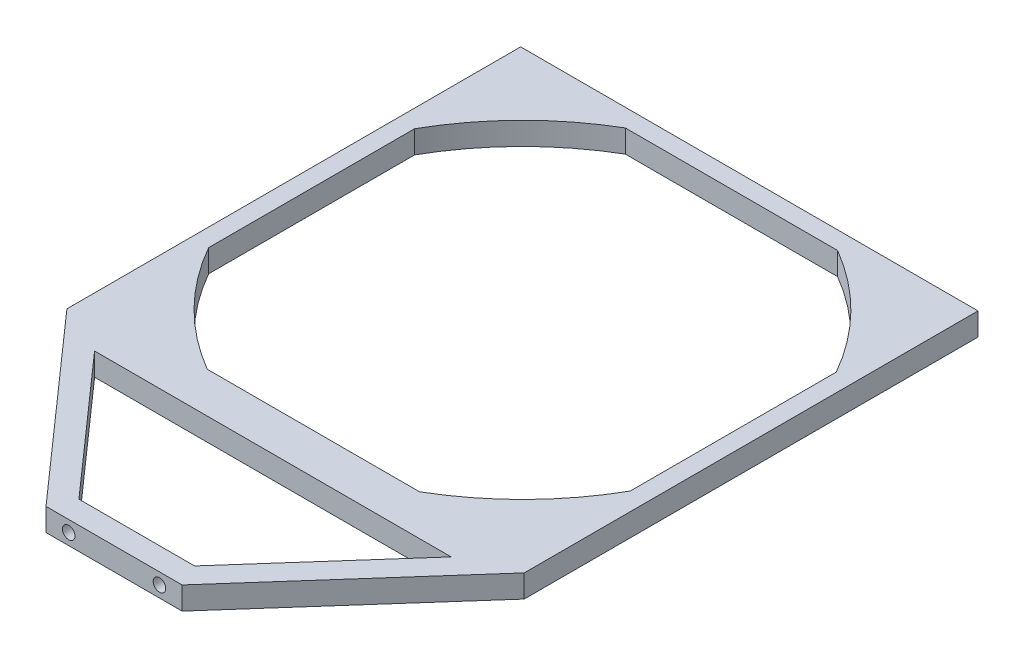
ISO-10303-21;
HEADER;
FILE_DESCRIPTION(('STEP AP214'),'2;1');
FILE_NAME('part.step','',(''),(''),'','','');
FILE_SCHEMA(('AUTOMOTIVE_DESIGN { 1 0 10303 214 1 1 1 1 }'));
ENDSEC;
DATA;
#1=APPLICATION_CONTEXT('core data for automotive mechanical design processes');
#2=APPLICATION_PROTOCOL_DEFINITION('international standard','automotive_design',2000,#1);
#3=PRODUCT_CONTEXT('',#1,'mechanical');
#4=PRODUCT('Part','Part','',(#3));
#5=PRODUCT_RELATED_PRODUCT_CATEGORY('part','',(#4));
#6=PRODUCT_DEFINITION_FORMATION('','',#4);
#7=PRODUCT_DEFINITION_CONTEXT('part definition',#1,'design');
#8=PRODUCT_DEFINITION('design','',#6,#7);
#9=PRODUCT_DEFINITION_SHAPE('','',#8);
#10=(LENGTH_UNIT() NAMED_UNIT(*) SI_UNIT(.MILLI.,.METRE.));
#11=(NAMED_UNIT(*) PLANE_ANGLE_UNIT() SI_UNIT($,.RADIAN.));
#12=(NAMED_UNIT(*) SI_UNIT($,.STERADIAN.) SOLID_ANGLE_UNIT());
#13=UNCERTAINTY_MEASURE_WITH_UNIT(LENGTH_MEASURE(1.E-05),#10,'distance_accuracy_value','');
#14=(GEOMETRIC_REPRESENTATION_CONTEXT(3) GLOBAL_UNCERTAINTY_ASSIGNED_CONTEXT((#13)) GLOBAL_UNIT_ASSIGNED_CONTEXT((#10,
#11,#12)) REPRESENTATION_CONTEXT('',''));
#15=CARTESIAN_POINT('',(0.,0.,0.));
#16=DIRECTION('',(0.,0.,1.));
#17=DIRECTION('',(1.,0.,0.));
#18=AXIS2_PLACEMENT_3D('',#15,#16,#17);
#19=CARTESIAN_POINT('',(-64.,6.35,63.4999999999999));
#20=DIRECTION('',(0.,1.,0.));
#21=DIRECTION('',(0.,0.,1.));
#22=AXIS2_PLACEMENT_3D('',#19,#20,#21);
#23=PLANE('',#22);
#24=DIRECTION('',(0.,0.,1.));
#25=VECTOR('',#24,1.);
#26=CARTESIAN_POINT('',(-64.,6.35,-63.5));
#27=LINE('',#26,#25);
#28=CARTESIAN_POINT('',(-64.,6.35,-63.5));
#29=VERTEX_POINT('',#28);
#30=CARTESIAN_POINT('',(-64.,6.35,63.4999999999999));
#31=VERTEX_POINT('',#30);
#32=EDGE_CURVE('E282',#29,#31,#27,.T.);
#33=ORIENTED_EDGE('',*,*,#32,.T.);
#34=DIRECTION('',(0.662669304581894,0.,0.748912139549727));
#35=VECTOR('',#34,1.);
#36=CARTESIAN_POINT('',(-64.,6.35,63.4999999999999));
#37=LINE('',#36,#35);
#38=CARTESIAN_POINT('',(-19.05,6.35,114.3));
#39=VERTEX_POINT('',#38);
#40=EDGE_CURVE('E203',#31,#39,#37,.T.);
#41=ORIENTED_EDGE('',*,*,#40,.T.);
#42=DIRECTION('',(1.,0.,0.));
#43=VECTOR('',#42,1.);
#44=CARTESIAN_POINT('',(-19.05,6.35,114.3));
#45=LINE('',#44,#43);
#46=CARTESIAN_POINT('',(19.05,6.35,114.3));
#47=VERTEX_POINT('',#46);
#48=EDGE_CURVE('E220',#39,#47,#45,.T.);
#49=ORIENTED_EDGE('',*,*,#48,.T.);
#50=DIRECTION('',(0.662669304581894,0.,-0.748912139549727));
#51=VECTOR('',#50,1.);
#52=CARTESIAN_POINT('',(19.05,6.35,114.3));
#53=LINE('',#52,#51);
#54=CARTESIAN_POINT('',(64.,6.35,63.5));
#55=VERTEX_POINT('',#54);
#56=EDGE_CURVE('E211',#47,#55,#53,.T.);
#57=ORIENTED_EDGE('',*,*,#56,.T.);
#58=DIRECTION('',(0.,0.,-1.));
#59=VECTOR('',#58,1.);
#60=CARTESIAN_POINT('',(64.,6.35,63.5));
#61=LINE('',#60,#59);
#62=CARTESIAN_POINT('',(64.,6.35,-63.5));
#63=VERTEX_POINT('',#62);
#64=EDGE_CURVE('E284',#55,#63,#61,.T.);
#65=ORIENTED_EDGE('',*,*,#64,.T.);
#66=DIRECTION('',(-1.,0.,0.));
#67=VECTOR('',#66,1.);
#68=CARTESIAN_POINT('',(64.,6.35,-63.5));
#69=LINE('',#68,#67);
#70=EDGE_CURVE('E287',#63,#29,#69,.T.);
#71=ORIENTED_EDGE('',*,*,#70,.T.);
#72=EDGE_LOOP('',(#33,#41,#49,#57,#65,#71));
#73=FACE_BOUND('',#72,.T.);
#74=DIRECTION('',(0.,0.,1.));
#75=VECTOR('',#74,1.);
#76=CARTESIAN_POINT('',(-59.,6.35,-28.8258848548213));
#77=LINE('',#76,#75);
#78=CARTESIAN_POINT('',(-59.,6.35,-28.8258848548213));
#79=VERTEX_POINT('',#78);
#80=CARTESIAN_POINT('',(-59.,6.35,28.8258848548212));
#81=VERTEX_POINT('',#80);
#82=EDGE_CURVE('E230',#79,#81,#77,.T.);
#83=ORIENTED_EDGE('',*,*,#82,.F.);
#84=CARTESIAN_POINT('',(10.6066017177982,6.35,10.6066017177982));
#85=DIRECTION('',(0.,1.,0.));
#86=DIRECTION('',(0.,0.,1.));
#87=AXIS2_PLACEMENT_3D('',#84,#85,#86);
#88=CIRCLE('',#87,80.);
#89=CARTESIAN_POINT('',(-29.6957257462281,6.35,-58.5));
#90=VERTEX_POINT('',#89);
#91=EDGE_CURVE('E228',#90,#79,#88,.T.);
#92=ORIENTED_EDGE('',*,*,#91,.F.);
#93=DIRECTION('',(-1.,0.,0.));
#94=VECTOR('',#93,1.);
#95=CARTESIAN_POINT('',(29.6957257462282,6.35,-58.5));
#96=LINE('',#95,#94);
#97=CARTESIAN_POINT('',(29.6957257462282,6.35,-58.5));
#98=VERTEX_POINT('',#97);
#99=EDGE_CURVE('E243',#98,#90,#96,.T.);
#100=ORIENTED_EDGE('',*,*,#99,.F.);
#101=CARTESIAN_POINT('',(-10.6066017177982,6.35,10.6066017177982));
#102=DIRECTION('',(0.,1.,0.));
#103=DIRECTION('',(0.,0.,-1.));
#104=AXIS2_PLACEMENT_3D('',#101,#102,#103);
#105=CIRCLE('',#104,80.);
#106=CARTESIAN_POINT('',(59.,6.35,-28.8258848548212));
#107=VERTEX_POINT('',#106);
#108=EDGE_CURVE('E241',#107,#98,#105,.T.);
#109=ORIENTED_EDGE('',*,*,#108,.F.);
#110=DIRECTION('',(0.,0.,-1.));
#111=VECTOR('',#110,1.);
#112=CARTESIAN_POINT('',(59.,6.35,-28.8258848548212));
#113=LINE('',#112,#111);
#114=CARTESIAN_POINT('',(59.,6.35,28.8258848548213));
#115=VERTEX_POINT('',#114);
#116=EDGE_CURVE('E239',#115,#107,#113,.T.);
#117=ORIENTED_EDGE('',*,*,#116,.F.);
#118=CARTESIAN_POINT('',(-10.6066017177982,6.35,-10.6066017177982));
#119=DIRECTION('',(0.,1.,0.));
#120=DIRECTION('',(0.,0.,-1.));
#121=AXIS2_PLACEMENT_3D('',#118,#119,#120);
#122=CIRCLE('',#121,80.);
#123=CARTESIAN_POINT('',(29.6957257462282,6.35,58.4999999999999));
#124=VERTEX_POINT('',#123);
#125=EDGE_CURVE('E237',#124,#115,#122,.T.);
#126=ORIENTED_EDGE('',*,*,#125,.F.);
#127=DIRECTION('',(1.,0.,0.));
#128=VECTOR('',#127,1.);
#129=CARTESIAN_POINT('',(-29.6957257462282,6.35,58.4999999999999));
#130=LINE('',#129,#128);
#131=CARTESIAN_POINT('',(-29.6957257462282,6.35,58.4999999999999));
#132=VERTEX_POINT('',#131);
#133=EDGE_CURVE('E235',#132,#124,#130,.T.);
#134=ORIENTED_EDGE('',*,*,#133,.F.);
#135=CARTESIAN_POINT('',(10.6066017177982,6.35,-10.6066017177982));
#136=DIRECTION('',(0.,1.,0.));
#137=DIRECTION('',(0.,0.,1.));
#138=AXIS2_PLACEMENT_3D('',#135,#136,#137);
#139=CIRCLE('',#138,80.);
#140=EDGE_CURVE('E233',#81,#132,#139,.T.);
#141=ORIENTED_EDGE('',*,*,#140,.F.);
#142=EDGE_LOOP('',(#83,#92,#100,#109,#117,#126,#134,#141));
#143=FACE_BOUND('',#142,.T.);
#144=DIRECTION('',(-1.,0.,0.));
#145=VECTOR('',#144,1.);
#146=CARTESIAN_POINT('',(-49.9022847587397,6.35,69.8499999999999));
#147=LINE('',#146,#145);
#148=CARTESIAN_POINT('',(49.9022847587397,6.35,69.8499999999999));
#149=VERTEX_POINT('',#148);
#150=CARTESIAN_POINT('',(-49.9022847587397,6.35,69.8499999999999));
#151=VERTEX_POINT('',#150);
#152=EDGE_CURVE('E168',#149,#151,#147,.T.);
#153=ORIENTED_EDGE('',*,*,#152,.F.);
#154=DIRECTION('',(0.662669304581894,0.,-0.748912139549726));
#155=VECTOR('',#154,1.);
#156=CARTESIAN_POINT('',(16.1897847587397,6.35,107.95));
#157=LINE('',#156,#155);
#158=CARTESIAN_POINT('',(16.1897847587397,6.35,107.95));
#159=VERTEX_POINT('',#158);
#160=EDGE_CURVE('E185',#159,#149,#157,.T.);
#161=ORIENTED_EDGE('',*,*,#160,.F.);
#162=DIRECTION('',(1.,0.,0.));
#163=VECTOR('',#162,1.);
#164=CARTESIAN_POINT('',(-16.1897847587397,6.35,107.95));
#165=LINE('',#164,#163);
#166=CARTESIAN_POINT('',(-16.1897847587397,6.35,107.95));
#167=VERTEX_POINT('',#166);
#168=EDGE_CURVE('E188',#167,#159,#165,.T.);
#169=ORIENTED_EDGE('',*,*,#168,.F.);
#170=DIRECTION('',(0.662669304581894,0.,0.748912139549727));
#171=VECTOR('',#170,1.);
#172=CARTESIAN_POINT('',(-49.9022847587397,6.35,69.8499999999999));
#173=LINE('',#172,#171);
#174=EDGE_CURVE('E197',#151,#167,#173,.T.);
#175=ORIENTED_EDGE('',*,*,#174,.F.);
#176=EDGE_LOOP('',(#153,#161,#169,#175));
#177=FACE_BOUND('',#176,.T.);
#178=ADVANCED_FACE('F33',(#73,#143,#177),#23,.T.);
#179=CARTESIAN_POINT('',(-64.,0.,63.4999999999999));
#180=DIRECTION('',(0.,1.,0.));
#181=DIRECTION('',(0.,0.,1.));
#182=AXIS2_PLACEMENT_3D('',#179,#180,#181);
#183=PLANE('',#182);
#184=DIRECTION('',(0.,0.,1.));
#185=VECTOR('',#184,1.);
#186=CARTESIAN_POINT('',(-64.,0.,-63.5));
#187=LINE('',#186,#185);
#188=CARTESIAN_POINT('',(-64.,0.,-63.5));
#189=VERTEX_POINT('',#188);
#190=CARTESIAN_POINT('',(-64.,0.,63.4999999999999));
#191=VERTEX_POINT('',#190);
#192=EDGE_CURVE('E281',#189,#191,#187,.T.);
#193=ORIENTED_EDGE('',*,*,#192,.F.);
#194=DIRECTION('',(-1.,0.,0.));
#195=VECTOR('',#194,1.);
#196=CARTESIAN_POINT('',(64.,0.,-63.5));
#197=LINE('',#196,#195);
#198=CARTESIAN_POINT('',(64.,0.,-63.5));
#199=VERTEX_POINT('',#198);
#200=EDGE_CURVE('E285',#199,#189,#197,.T.);
#201=ORIENTED_EDGE('',*,*,#200,.F.);
#202=DIRECTION('',(0.,0.,-1.));
#203=VECTOR('',#202,1.);
#204=CARTESIAN_POINT('',(64.,0.,63.5));
#205=LINE('',#204,#203);
#206=CARTESIAN_POINT('',(64.,0.,63.5));
#207=VERTEX_POINT('',#206);
#208=EDGE_CURVE('E291',#207,#199,#205,.T.);
#209=ORIENTED_EDGE('',*,*,#208,.F.);
#210=DIRECTION('',(0.662669304581894,0.,-0.748912139549727));
#211=VECTOR('',#210,1.);
#212=CARTESIAN_POINT('',(19.05,0.,114.3));
#213=LINE('',#212,#211);
#214=CARTESIAN_POINT('',(19.05,0.,114.3));
#215=VERTEX_POINT('',#214);
#216=EDGE_CURVE('E214',#215,#207,#213,.T.);
#217=ORIENTED_EDGE('',*,*,#216,.F.);
#218=DIRECTION('',(1.,0.,0.));
#219=VECTOR('',#218,1.);
#220=CARTESIAN_POINT('',(-19.05,0.,114.3));
#221=LINE('',#220,#219);
#222=CARTESIAN_POINT('',(-19.05,0.,114.3));
#223=VERTEX_POINT('',#222);
#224=EDGE_CURVE('E210',#223,#215,#221,.T.);
#225=ORIENTED_EDGE('',*,*,#224,.F.);
#226=DIRECTION('',(0.662669304581894,0.,0.748912139549727));
#227=VECTOR('',#226,1.);
#228=CARTESIAN_POINT('',(-64.,0.,63.4999999999999));
#229=LINE('',#228,#227);
#230=EDGE_CURVE('E207',#191,#223,#229,.T.);
#231=ORIENTED_EDGE('',*,*,#230,.F.);
#232=EDGE_LOOP('',(#193,#201,#209,#217,#225,#231));
#233=FACE_BOUND('',#232,.T.);
#234=CARTESIAN_POINT('',(10.6066017177982,0.,10.6066017177982));
#235=DIRECTION('',(0.,1.,0.));
#236=DIRECTION('',(0.,0.,1.));
#237=AXIS2_PLACEMENT_3D('',#234,#235,#236);
#238=CIRCLE('',#237,80.);
#239=CARTESIAN_POINT('',(-29.6957257462281,0.,-58.5));
#240=VERTEX_POINT('',#239);
#241=CARTESIAN_POINT('',(-59.,0.,-28.8258848548213));
#242=VERTEX_POINT('',#241);
#243=EDGE_CURVE('E57',#240,#242,#238,.T.);
#244=ORIENTED_EDGE('',*,*,#243,.T.);
#245=DIRECTION('',(0.,0.,1.));
#246=VECTOR('',#245,1.);
#247=CARTESIAN_POINT('',(-59.,0.,-28.8258848548213));
#248=LINE('',#247,#246);
#249=CARTESIAN_POINT('',(-59.,0.,28.8258848548212));
#250=VERTEX_POINT('',#249);
#251=EDGE_CURVE('E247',#242,#250,#248,.T.);
#252=ORIENTED_EDGE('',*,*,#251,.T.);
#253=CARTESIAN_POINT('',(10.6066017177982,0.,-10.6066017177982));
#254=DIRECTION('',(0.,1.,0.));
#255=DIRECTION('',(0.,0.,1.));
#256=AXIS2_PLACEMENT_3D('',#253,#254,#255);
#257=CIRCLE('',#256,80.);
#258=CARTESIAN_POINT('',(-29.6957257462282,0.,58.4999999999999));
#259=VERTEX_POINT('',#258);
#260=EDGE_CURVE('E250',#250,#259,#257,.T.);
#261=ORIENTED_EDGE('',*,*,#260,.T.);
#262=DIRECTION('',(1.,0.,0.));
#263=VECTOR('',#262,1.);
#264=CARTESIAN_POINT('',(-29.6957257462282,0.,58.4999999999999));
#265=LINE('',#264,#263);
#266=CARTESIAN_POINT('',(29.6957257462282,0.,58.4999999999999));
#267=VERTEX_POINT('',#266);
#268=EDGE_CURVE('E253',#259,#267,#265,.T.);
#269=ORIENTED_EDGE('',*,*,#268,.T.);
#270=CARTESIAN_POINT('',(-10.6066017177982,0.,-10.6066017177982));
#271=DIRECTION('',(0.,1.,0.));
#272=DIRECTION('',(0.,0.,-1.));
#273=AXIS2_PLACEMENT_3D('',#270,#271,#272);
#274=CIRCLE('',#273,80.);
#275=CARTESIAN_POINT('',(59.,0.,28.8258848548213));
#276=VERTEX_POINT('',#275);
#277=EDGE_CURVE('E256',#267,#276,#274,.T.);
#278=ORIENTED_EDGE('',*,*,#277,.T.);
#279=DIRECTION('',(0.,0.,-1.));
#280=VECTOR('',#279,1.);
#281=CARTESIAN_POINT('',(59.,0.,-28.8258848548212));
#282=LINE('',#281,#280);
#283=CARTESIAN_POINT('',(59.,0.,-28.8258848548212));
#284=VERTEX_POINT('',#283);
#285=EDGE_CURVE('E259',#276,#284,#282,.T.);
#286=ORIENTED_EDGE('',*,*,#285,.T.);
#287=CARTESIAN_POINT('',(-10.6066017177982,0.,10.6066017177982));
#288=DIRECTION('',(0.,1.,0.));
#289=DIRECTION('',(0.,0.,-1.));
#290=AXIS2_PLACEMENT_3D('',#287,#288,#289);
#291=CIRCLE('',#290,80.);
#292=CARTESIAN_POINT('',(29.6957257462282,0.,-58.5));
#293=VERTEX_POINT('',#292);
#294=EDGE_CURVE('E262',#284,#293,#291,.T.);
#295=ORIENTED_EDGE('',*,*,#294,.T.);
#296=DIRECTION('',(-1.,0.,0.));
#297=VECTOR('',#296,1.);
#298=CARTESIAN_POINT('',(29.6957257462282,0.,-58.5));
#299=LINE('',#298,#297);
#300=EDGE_CURVE('E231',#293,#240,#299,.T.);
#301=ORIENTED_EDGE('',*,*,#300,.T.);
#302=EDGE_LOOP('',(#244,#252,#261,#269,#278,#286,#295,#301));
#303=FACE_BOUND('',#302,.T.);
#304=DIRECTION('',(0.662669304581894,0.,-0.748912139549726));
#305=VECTOR('',#304,1.);
#306=CARTESIAN_POINT('',(16.1897847587397,0.,107.95));
#307=LINE('',#306,#305);
#308=CARTESIAN_POINT('',(16.1897847587397,0.,107.95));
#309=VERTEX_POINT('',#308);
#310=CARTESIAN_POINT('',(49.9022847587397,0.,69.8499999999999));
#311=VERTEX_POINT('',#310);
#312=EDGE_CURVE('E173',#309,#311,#307,.T.);
#313=ORIENTED_EDGE('',*,*,#312,.T.);
#314=DIRECTION('',(-1.,0.,0.));
#315=VECTOR('',#314,1.);
#316=CARTESIAN_POINT('',(-49.9022847587397,0.,69.8499999999999));
#317=LINE('',#316,#315);
#318=CARTESIAN_POINT('',(-49.9022847587397,0.,69.8499999999999));
#319=VERTEX_POINT('',#318);
#320=EDGE_CURVE('E165',#311,#319,#317,.T.);
#321=ORIENTED_EDGE('',*,*,#320,.T.);
#322=DIRECTION('',(0.662669304581894,0.,0.748912139549727));
#323=VECTOR('',#322,1.);
#324=CARTESIAN_POINT('',(-49.9022847587397,0.,69.8499999999999));
#325=LINE('',#324,#323);
#326=CARTESIAN_POINT('',(-16.1897847587397,0.,107.95));
#327=VERTEX_POINT('',#326);
#328=EDGE_CURVE('E177',#319,#327,#325,.T.);
#329=ORIENTED_EDGE('',*,*,#328,.T.);
#330=DIRECTION('',(1.,0.,0.));
#331=VECTOR('',#330,1.);
#332=CARTESIAN_POINT('',(-16.1897847587397,0.,107.95));
#333=LINE('',#332,#331);
#334=EDGE_CURVE('E181',#327,#309,#333,.T.);
#335=ORIENTED_EDGE('',*,*,#334,.T.);
#336=EDGE_LOOP('',(#313,#321,#329,#335));
#337=FACE_BOUND('',#336,.T.);
#338=ADVANCED_FACE('F183',(#233,#303,#337),#183,.F.);
#339=CARTESIAN_POINT('',(-64.,6.35,-63.5));
#340=DIRECTION('',(1.,0.,0.));
#341=DIRECTION('',(0.,0.,-1.));
#342=AXIS2_PLACEMENT_3D('',#339,#340,#341);
#343=PLANE('',#342);
#344=ORIENTED_EDGE('',*,*,#192,.T.);
#345=DIRECTION('',(0.,-1.,0.));
#346=VECTOR('',#345,1.);
#347=CARTESIAN_POINT('',(-64.,6.35,63.4999999999999));
#348=LINE('',#347,#346);
#349=EDGE_CURVE('E11',#31,#191,#348,.T.);
#350=ORIENTED_EDGE('',*,*,#349,.F.);
#351=ORIENTED_EDGE('',*,*,#32,.F.);
#352=DIRECTION('',(0.,-1.,0.));
#353=VECTOR('',#352,1.);
#354=CARTESIAN_POINT('',(-64.,6.35,-63.5));
#355=LINE('',#354,#353);
#356=EDGE_CURVE('E289',#29,#189,#355,.T.);
#357=ORIENTED_EDGE('',*,*,#356,.T.);
#358=EDGE_LOOP('',(#344,#350,#351,#357));
#359=FACE_BOUND('',#358,.T.);
#360=ADVANCED_FACE('F35',(#359),#343,.F.);
#361=CARTESIAN_POINT('',(64.,6.35,63.5));
#362=DIRECTION('',(-1.,0.,0.));
#363=DIRECTION('',(0.,0.,1.));
#364=AXIS2_PLACEMENT_3D('',#361,#362,#363);
#365=PLANE('',#364);
#366=ORIENTED_EDGE('',*,*,#208,.T.);
#367=DIRECTION('',(0.,-1.,0.));
#368=VECTOR('',#367,1.);
#369=CARTESIAN_POINT('',(64.,6.35,-63.5));
#370=LINE('',#369,#368);
#371=EDGE_CURVE('E296',#63,#199,#370,.T.);
#372=ORIENTED_EDGE('',*,*,#371,.F.);
#373=ORIENTED_EDGE('',*,*,#64,.F.);
#374=DIRECTION('',(0.,-1.,0.));
#375=VECTOR('',#374,1.);
#376=CARTESIAN_POINT('',(64.,6.35,63.5));
#377=LINE('',#376,#375);
#378=EDGE_CURVE('E42',#55,#207,#377,.T.);
#379=ORIENTED_EDGE('',*,*,#378,.T.);
#380=EDGE_LOOP('',(#366,#372,#373,#379));
#381=FACE_BOUND('',#380,.T.);
#382=ADVANCED_FACE('F302',(#381),#365,.F.);
#383=CARTESIAN_POINT('',(64.,6.35,-63.5));
#384=DIRECTION('',(0.,0.,1.));
#385=DIRECTION('',(1.,0.,0.));
#386=AXIS2_PLACEMENT_3D('',#383,#384,#385);
#387=PLANE('',#386);
#388=ORIENTED_EDGE('',*,*,#200,.T.);
#389=ORIENTED_EDGE('',*,*,#356,.F.);
#390=ORIENTED_EDGE('',*,*,#70,.F.);
#391=ORIENTED_EDGE('',*,*,#371,.T.);
#392=EDGE_LOOP('',(#388,#389,#390,#391));
#393=FACE_BOUND('',#392,.T.);
#394=ADVANCED_FACE('F326',(#393),#387,.F.);
#395=CARTESIAN_POINT('',(10.6066017177982,6.35,10.6066017177982));
#396=DIRECTION('',(0.,-1.,0.));
#397=DIRECTION('',(0.,0.,-1.));
#398=AXIS2_PLACEMENT_3D('',#395,#396,#397);
#399=CYLINDRICAL_SURFACE('',#398,80.);
#400=ORIENTED_EDGE('',*,*,#243,.F.);
#401=DIRECTION('',(0.,-1.,0.));
#402=VECTOR('',#401,1.);
#403=CARTESIAN_POINT('',(-29.6957257462281,6.35,-58.5));
#404=LINE('',#403,#402);
#405=EDGE_CURVE('E245',#90,#240,#404,.T.);
#406=ORIENTED_EDGE('',*,*,#405,.F.);
#407=ORIENTED_EDGE('',*,*,#91,.T.);
#408=DIRECTION('',(0.,-1.,0.));
#409=VECTOR('',#408,1.);
#410=CARTESIAN_POINT('',(-59.,6.35,-28.8258848548213));
#411=LINE('',#410,#409);
#412=EDGE_CURVE('E279',#79,#242,#411,.T.);
#413=ORIENTED_EDGE('',*,*,#412,.T.);
#414=EDGE_LOOP('',(#400,#406,#407,#413));
#415=FACE_BOUND('',#414,.T.);
#416=ADVANCED_FACE('F389',(#415),#399,.F.);
#417=CARTESIAN_POINT('',(-59.,6.35,-28.8258848548213));
#418=DIRECTION('',(1.,0.,0.));
#419=DIRECTION('',(0.,0.,-1.));
#420=AXIS2_PLACEMENT_3D('',#417,#418,#419);
#421=PLANE('',#420);
#422=ORIENTED_EDGE('',*,*,#251,.F.);
#423=ORIENTED_EDGE('',*,*,#412,.F.);
#424=ORIENTED_EDGE('',*,*,#82,.T.);
#425=DIRECTION('',(0.,-1.,0.));
#426=VECTOR('',#425,1.);
#427=CARTESIAN_POINT('',(-59.,6.35,28.8258848548212));
#428=LINE('',#427,#426);
#429=EDGE_CURVE('E277',#81,#250,#428,.T.);
#430=ORIENTED_EDGE('',*,*,#429,.T.);
#431=EDGE_LOOP('',(#422,#423,#424,#430));
#432=FACE_BOUND('',#431,.T.);
#433=ADVANCED_FACE('F385',(#432),#421,.T.);
#434=CARTESIAN_POINT('',(10.6066017177982,6.35,-10.6066017177982));
#435=DIRECTION('',(0.,-1.,0.));
#436=DIRECTION('',(0.,0.,-1.));
#437=AXIS2_PLACEMENT_3D('',#434,#435,#436);
#438=CYLINDRICAL_SURFACE('',#437,80.);
#439=ORIENTED_EDGE('',*,*,#260,.F.);
#440=ORIENTED_EDGE('',*,*,#429,.F.);
#441=ORIENTED_EDGE('',*,*,#140,.T.);
#442=DIRECTION('',(0.,-1.,0.));
#443=VECTOR('',#442,1.);
#444=CARTESIAN_POINT('',(-29.6957257462282,6.35,58.4999999999999));
#445=LINE('',#444,#443);
#446=EDGE_CURVE('E275',#132,#259,#445,.T.);
#447=ORIENTED_EDGE('',*,*,#446,.T.);
#448=EDGE_LOOP('',(#439,#440,#441,#447));
#449=FACE_BOUND('',#448,.T.);
#450=ADVANCED_FACE('F381',(#449),#438,.F.);
#451=CARTESIAN_POINT('',(-29.6957257462282,6.35,58.4999999999999));
#452=DIRECTION('',(0.,0.,-1.));
#453=DIRECTION('',(-1.,0.,0.));
#454=AXIS2_PLACEMENT_3D('',#451,#452,#453);
#455=PLANE('',#454);
#456=ORIENTED_EDGE('',*,*,#268,.F.);
#457=ORIENTED_EDGE('',*,*,#446,.F.);
#458=ORIENTED_EDGE('',*,*,#133,.T.);
#459=DIRECTION('',(0.,-1.,0.));
#460=VECTOR('',#459,1.);
#461=CARTESIAN_POINT('',(29.6957257462282,6.35,58.4999999999999));
#462=LINE('',#461,#460);
#463=EDGE_CURVE('E273',#124,#267,#462,.T.);
#464=ORIENTED_EDGE('',*,*,#463,.T.);
#465=EDGE_LOOP('',(#456,#457,#458,#464));
#466=FACE_BOUND('',#465,.T.);
#467=ADVANCED_FACE('F377',(#466),#455,.T.);
#468=CARTESIAN_POINT('',(-10.6066017177982,6.35,-10.6066017177982));
#469=DIRECTION('',(0.,-1.,0.));
#470=DIRECTION('',(0.,0.,-1.));
#471=AXIS2_PLACEMENT_3D('',#468,#469,#470);
#472=CYLINDRICAL_SURFACE('',#471,80.);
#473=ORIENTED_EDGE('',*,*,#277,.F.);
#474=ORIENTED_EDGE('',*,*,#463,.F.);
#475=ORIENTED_EDGE('',*,*,#125,.T.);
#476=DIRECTION('',(0.,-1.,0.));
#477=VECTOR('',#476,1.);
#478=CARTESIAN_POINT('',(59.,6.35,28.8258848548213));
#479=LINE('',#478,#477);
#480=EDGE_CURVE('E271',#115,#276,#479,.T.);
#481=ORIENTED_EDGE('',*,*,#480,.T.);
#482=EDGE_LOOP('',(#473,#474,#475,#481));
#483=FACE_BOUND('',#482,.T.);
#484=ADVANCED_FACE('F373',(#483),#472,.F.);
#485=CARTESIAN_POINT('',(59.,6.35,-28.8258848548212));
#486=DIRECTION('',(-1.,0.,0.));
#487=DIRECTION('',(0.,0.,1.));
#488=AXIS2_PLACEMENT_3D('',#485,#486,#487);
#489=PLANE('',#488);
#490=ORIENTED_EDGE('',*,*,#285,.F.);
#491=ORIENTED_EDGE('',*,*,#480,.F.);
#492=ORIENTED_EDGE('',*,*,#116,.T.);
#493=DIRECTION('',(0.,-1.,0.));
#494=VECTOR('',#493,1.);
#495=CARTESIAN_POINT('',(59.,6.35,-28.8258848548212));
#496=LINE('',#495,#494);
#497=EDGE_CURVE('E269',#107,#284,#496,.T.);
#498=ORIENTED_EDGE('',*,*,#497,.T.);
#499=EDGE_LOOP('',(#490,#491,#492,#498));
#500=FACE_BOUND('',#499,.T.);
#501=ADVANCED_FACE('F369',(#500),#489,.T.);
#502=CARTESIAN_POINT('',(-10.6066017177982,6.35,10.6066017177982));
#503=DIRECTION('',(0.,-1.,0.));
#504=DIRECTION('',(0.,0.,-1.));
#505=AXIS2_PLACEMENT_3D('',#502,#503,#504);
#506=CYLINDRICAL_SURFACE('',#505,80.);
#507=ORIENTED_EDGE('',*,*,#294,.F.);
#508=ORIENTED_EDGE('',*,*,#497,.F.);
#509=ORIENTED_EDGE('',*,*,#108,.T.);
#510=DIRECTION('',(0.,-1.,0.));
#511=VECTOR('',#510,1.);
#512=CARTESIAN_POINT('',(29.6957257462282,6.35,-58.5));
#513=LINE('',#512,#511);
#514=EDGE_CURVE('E49',#98,#293,#513,.T.);
#515=ORIENTED_EDGE('',*,*,#514,.T.);
#516=EDGE_LOOP('',(#507,#508,#509,#515));
#517=FACE_BOUND('',#516,.T.);
#518=ADVANCED_FACE('F366',(#517),#506,.F.);
#519=CARTESIAN_POINT('',(29.6957257462282,6.35,-58.5));
#520=DIRECTION('',(0.,0.,1.));
#521=DIRECTION('',(1.,0.,0.));
#522=AXIS2_PLACEMENT_3D('',#519,#520,#521);
#523=PLANE('',#522);
#524=ORIENTED_EDGE('',*,*,#300,.F.);
#525=ORIENTED_EDGE('',*,*,#514,.F.);
#526=ORIENTED_EDGE('',*,*,#99,.T.);
#527=ORIENTED_EDGE('',*,*,#405,.T.);
#528=EDGE_LOOP('',(#524,#525,#526,#527));
#529=FACE_BOUND('',#528,.T.);
#530=ADVANCED_FACE('F358',(#529),#523,.T.);
#531=CARTESIAN_POINT('',(19.05,0.,114.3));
#532=DIRECTION('',(0.748912139549726,0.,0.662669304581894));
#533=DIRECTION('',(0.662669304581894,0.,-0.748912139549727));
#534=AXIS2_PLACEMENT_3D('',#531,#532,#533);
#535=PLANE('',#534);
#536=ORIENTED_EDGE('',*,*,#56,.F.);
#537=DIRECTION('',(0.,1.,0.));
#538=VECTOR('',#537,1.);
#539=CARTESIAN_POINT('',(19.05,0.,114.3));
#540=LINE('',#539,#538);
#541=EDGE_CURVE('E225',#215,#47,#540,.T.);
#542=ORIENTED_EDGE('',*,*,#541,.F.);
#543=ORIENTED_EDGE('',*,*,#216,.T.);
#544=ORIENTED_EDGE('',*,*,#378,.F.);
#545=EDGE_LOOP('',(#536,#542,#543,#544));
#546=FACE_BOUND('',#545,.T.);
#547=ADVANCED_FACE('F312',(#546),#535,.T.);
#548=CARTESIAN_POINT('',(-19.05,0.,114.3));
#549=DIRECTION('',(0.,0.,1.));
#550=DIRECTION('',(1.,0.,0.));
#551=AXIS2_PLACEMENT_3D('',#548,#549,#550);
#552=PLANE('',#551);
#553=CARTESIAN_POINT('',(-12.7,3.175,114.3));
#554=DIRECTION('',(0.,0.,1.));
#555=DIRECTION('',(1.,0.,0.));
#556=AXIS2_PLACEMENT_3D('',#553,#554,#555);
#557=CIRCLE('',#556,1.7526000000001);
#558=CARTESIAN_POINT('',(-10.9473999999999,3.175,114.3));
#559=VERTEX_POINT('',#558);
#560=EDGE_CURVE('E538',#559,#559,#557,.T.);
#561=ORIENTED_EDGE('',*,*,#560,.F.);
#562=EDGE_LOOP('',(#561));
#563=FACE_BOUND('',#562,.T.);
#564=CARTESIAN_POINT('',(12.7,3.175,114.3));
#565=DIRECTION('',(0.,0.,1.));
#566=DIRECTION('',(1.,0.,0.));
#567=AXIS2_PLACEMENT_3D('',#564,#565,#566);
#568=CIRCLE('',#567,1.7526000000001);
#569=CARTESIAN_POINT('',(14.4526000000001,3.175,114.3));
#570=VERTEX_POINT('',#569);
#571=EDGE_CURVE('E541',#570,#570,#568,.T.);
#572=ORIENTED_EDGE('',*,*,#571,.F.);
#573=EDGE_LOOP('',(#572));
#574=FACE_BOUND('',#573,.T.);
#575=ORIENTED_EDGE('',*,*,#48,.F.);
#576=DIRECTION('',(0.,1.,0.));
#577=VECTOR('',#576,1.);
#578=CARTESIAN_POINT('',(-19.05,0.,114.3));
#579=LINE('',#578,#577);
#580=EDGE_CURVE('E217',#223,#39,#579,.T.);
#581=ORIENTED_EDGE('',*,*,#580,.F.);
#582=ORIENTED_EDGE('',*,*,#224,.T.);
#583=ORIENTED_EDGE('',*,*,#541,.T.);
#584=EDGE_LOOP('',(#575,#581,#582,#583));
#585=FACE_BOUND('',#584,.T.);
#586=ADVANCED_FACE('F315',(#563,#574,#585),#552,.T.);
#587=CARTESIAN_POINT('',(-64.,0.,63.4999999999999));
#588=DIRECTION('',(-0.748912139549727,0.,0.662669304581894));
#589=DIRECTION('',(0.662669304581894,0.,0.748912139549727));
#590=AXIS2_PLACEMENT_3D('',#587,#588,#589);
#591=PLANE('',#590);
#592=ORIENTED_EDGE('',*,*,#40,.F.);
#593=ORIENTED_EDGE('',*,*,#349,.T.);
#594=ORIENTED_EDGE('',*,*,#230,.T.);
#595=ORIENTED_EDGE('',*,*,#580,.T.);
#596=EDGE_LOOP('',(#592,#593,#594,#595));
#597=FACE_BOUND('',#596,.T.);
#598=ADVANCED_FACE('F319',(#597),#591,.T.);
#599=CARTESIAN_POINT('',(-49.9022847587397,0.,69.8499999999999));
#600=DIRECTION('',(0.,0.,-1.));
#601=DIRECTION('',(-1.,0.,0.));
#602=AXIS2_PLACEMENT_3D('',#599,#600,#601);
#603=PLANE('',#602);
#604=ORIENTED_EDGE('',*,*,#152,.T.);
#605=DIRECTION('',(0.,1.,0.));
#606=VECTOR('',#605,1.);
#607=CARTESIAN_POINT('',(-49.9022847587397,0.,69.8499999999999));
#608=LINE('',#607,#606);
#609=EDGE_CURVE('E161',#319,#151,#608,.T.);
#610=ORIENTED_EDGE('',*,*,#609,.F.);
#611=ORIENTED_EDGE('',*,*,#320,.F.);
#612=DIRECTION('',(0.,1.,0.));
#613=VECTOR('',#612,1.);
#614=CARTESIAN_POINT('',(49.9022847587397,0.,69.8499999999999));
#615=LINE('',#614,#613);
#616=EDGE_CURVE('E201',#311,#149,#615,.T.);
#617=ORIENTED_EDGE('',*,*,#616,.T.);
#618=EDGE_LOOP('',(#604,#610,#611,#617));
#619=FACE_BOUND('',#618,.T.);
#620=ADVANCED_FACE('F163',(#619),#603,.F.);
#621=CARTESIAN_POINT('',(16.1897847587397,0.,107.95));
#622=DIRECTION('',(0.748912139549726,0.,0.662669304581894));
#623=DIRECTION('',(0.662669304581894,0.,-0.748912139549727));
#624=AXIS2_PLACEMENT_3D('',#621,#622,#623);
#625=PLANE('',#624);
#626=ORIENTED_EDGE('',*,*,#160,.T.);
#627=ORIENTED_EDGE('',*,*,#616,.F.);
#628=ORIENTED_EDGE('',*,*,#312,.F.);
#629=DIRECTION('',(0.,1.,0.));
#630=VECTOR('',#629,1.);
#631=CARTESIAN_POINT('',(16.1897847587397,0.,107.95));
#632=LINE('',#631,#630);
#633=EDGE_CURVE('E204',#309,#159,#632,.T.);
#634=ORIENTED_EDGE('',*,*,#633,.T.);
#635=EDGE_LOOP('',(#626,#627,#628,#634));
#636=FACE_BOUND('',#635,.T.);
#637=ADVANCED_FACE('F340',(#636),#625,.F.);
#638=CARTESIAN_POINT('',(-16.1897847587397,0.,107.95));
#639=DIRECTION('',(0.,0.,1.));
#640=DIRECTION('',(1.,0.,0.));
#641=AXIS2_PLACEMENT_3D('',#638,#639,#640);
#642=PLANE('',#641);
#643=CARTESIAN_POINT('',(-12.7,3.175,107.95));
#644=DIRECTION('',(0.,0.,1.));
#645=DIRECTION('',(1.,0.,0.));
#646=AXIS2_PLACEMENT_3D('',#643,#644,#645);
#647=CIRCLE('',#646,1.7526000000001);
#648=CARTESIAN_POINT('',(-10.9473999999999,3.175,107.95));
#649=VERTEX_POINT('',#648);
#650=EDGE_CURVE('E37',#649,#649,#647,.T.);
#651=ORIENTED_EDGE('',*,*,#650,.T.);
#652=EDGE_LOOP('',(#651));
#653=FACE_BOUND('',#652,.T.);
#654=CARTESIAN_POINT('',(12.7,3.175,107.95));
#655=DIRECTION('',(0.,0.,1.));
#656=DIRECTION('',(1.,0.,0.));
#657=AXIS2_PLACEMENT_3D('',#654,#655,#656);
#658=CIRCLE('',#657,1.7526000000001);
#659=CARTESIAN_POINT('',(14.4526000000001,3.175,107.95));
#660=VERTEX_POINT('',#659);
#661=EDGE_CURVE('E191',#660,#660,#658,.T.);
#662=ORIENTED_EDGE('',*,*,#661,.T.);
#663=EDGE_LOOP('',(#662));
#664=FACE_BOUND('',#663,.T.);
#665=ORIENTED_EDGE('',*,*,#168,.T.);
#666=ORIENTED_EDGE('',*,*,#633,.F.);
#667=ORIENTED_EDGE('',*,*,#334,.F.);
#668=DIRECTION('',(0.,1.,0.));
#669=VECTOR('',#668,1.);
#670=CARTESIAN_POINT('',(-16.1897847587397,0.,107.95));
#671=LINE('',#670,#669);
#672=EDGE_CURVE('E172',#327,#167,#671,.T.);
#673=ORIENTED_EDGE('',*,*,#672,.T.);
#674=EDGE_LOOP('',(#665,#666,#667,#673));
#675=FACE_BOUND('',#674,.T.);
#676=ADVANCED_FACE('F338',(#653,#664,#675),#642,.F.);
#677=CARTESIAN_POINT('',(-49.9022847587397,0.,69.8499999999999));
#678=DIRECTION('',(-0.748912139549727,0.,0.662669304581894));
#679=DIRECTION('',(0.662669304581894,0.,0.748912139549727));
#680=AXIS2_PLACEMENT_3D('',#677,#678,#679);
#681=PLANE('',#680);
#682=ORIENTED_EDGE('',*,*,#174,.T.);
#683=ORIENTED_EDGE('',*,*,#672,.F.);
#684=ORIENTED_EDGE('',*,*,#328,.F.);
#685=ORIENTED_EDGE('',*,*,#609,.T.);
#686=EDGE_LOOP('',(#682,#683,#684,#685));
#687=FACE_BOUND('',#686,.T.);
#688=ADVANCED_FACE('F178',(#687),#681,.F.);
#689=CARTESIAN_POINT('',(12.7,3.175,114.3));
#690=DIRECTION('',(0.,0.,1.));
#691=DIRECTION('',(1.,0.,0.));
#692=AXIS2_PLACEMENT_3D('',#689,#690,#691);
#693=CYLINDRICAL_SURFACE('',#692,1.7526000000001);
#694=ORIENTED_EDGE('',*,*,#571,.T.);
#695=EDGE_LOOP('',(#694));
#696=FACE_BOUND('',#695,.T.);
#697=ORIENTED_EDGE('',*,*,#661,.F.);
#698=EDGE_LOOP('',(#697));
#699=FACE_BOUND('',#698,.T.);
#700=ADVANCED_FACE('F351',(#696,#699),#693,.F.);
#701=CARTESIAN_POINT('',(-12.7,3.175,114.3));
#702=DIRECTION('',(0.,0.,1.));
#703=DIRECTION('',(1.,0.,0.));
#704=AXIS2_PLACEMENT_3D('',#701,#702,#703);
#705=CYLINDRICAL_SURFACE('',#704,1.7526000000001);
#706=ORIENTED_EDGE('',*,*,#560,.T.);
#707=EDGE_LOOP('',(#706));
#708=FACE_BOUND('',#707,.T.);
#709=ORIENTED_EDGE('',*,*,#650,.F.);
#710=EDGE_LOOP('',(#709));
#711=FACE_BOUND('',#710,.T.);
#712=ADVANCED_FACE('F522',(#708,#711),#705,.F.);
#713=CLOSED_SHELL('',(#178,#338,#360,#382,#394,#416,#433,#450,#467,#484,#501,#518,#530,#547,
#586,#598,#620,#637,#676,#688,#700,#712));
#714=MANIFOLD_SOLID_BREP('B2',#713);
#715=ADVANCED_BREP_SHAPE_REPRESENTATION('',(#18,#714),#14);
#716=SHAPE_DEFINITION_REPRESENTATION(#9,#715);
ENDSEC;
END-ISO-10303-21;
